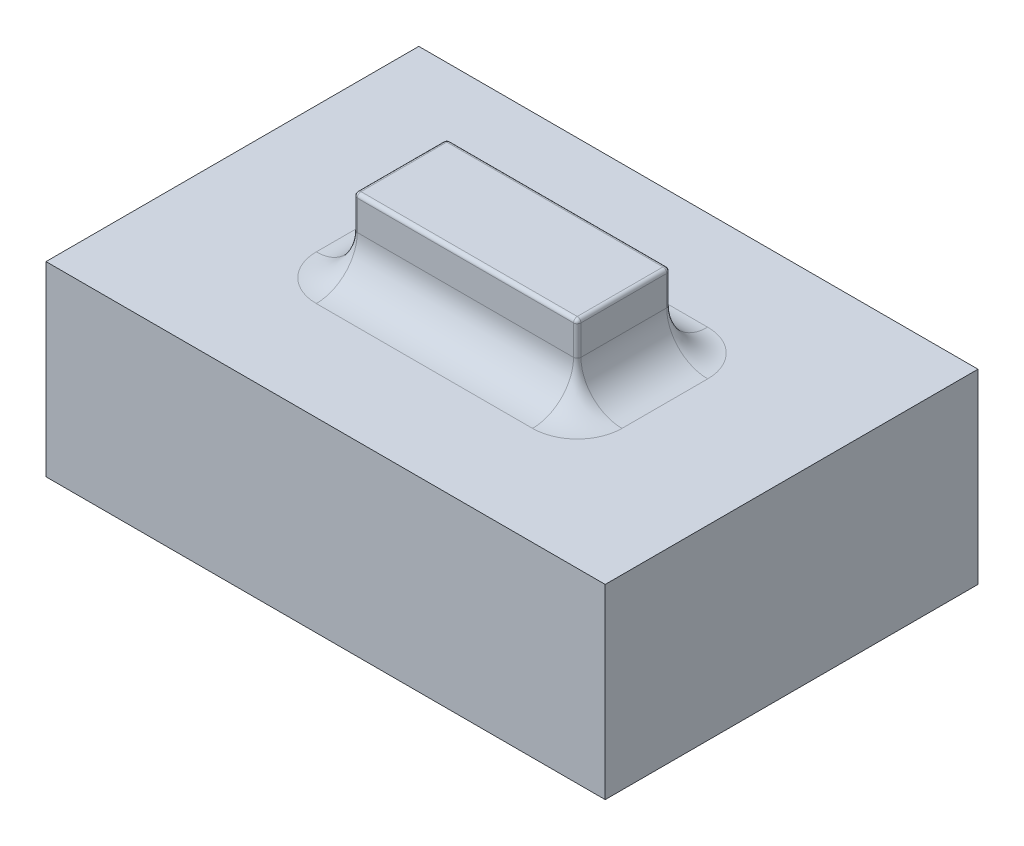
ISO-10303-21;
HEADER;
FILE_DESCRIPTION(('STEP AP214'),'2;1');
FILE_NAME('part.step','',(''),(''),'','','');
FILE_SCHEMA(('AUTOMOTIVE_DESIGN { 1 0 10303 214 1 1 1 1 }'));
ENDSEC;
DATA;
#1=APPLICATION_CONTEXT('core data for automotive mechanical design processes');
#2=APPLICATION_PROTOCOL_DEFINITION('international standard','automotive_design',2000,#1);
#3=PRODUCT_CONTEXT('',#1,'mechanical');
#4=PRODUCT('Part','Part','',(#3));
#5=PRODUCT_RELATED_PRODUCT_CATEGORY('part','',(#4));
#6=PRODUCT_DEFINITION_FORMATION('','',#4);
#7=PRODUCT_DEFINITION_CONTEXT('part definition',#1,'design');
#8=PRODUCT_DEFINITION('design','',#6,#7);
#9=PRODUCT_DEFINITION_SHAPE('','',#8);
#10=(LENGTH_UNIT() NAMED_UNIT(*) SI_UNIT(.MILLI.,.METRE.));
#11=(NAMED_UNIT(*) PLANE_ANGLE_UNIT() SI_UNIT($,.RADIAN.));
#12=(NAMED_UNIT(*) SI_UNIT($,.STERADIAN.) SOLID_ANGLE_UNIT());
#13=UNCERTAINTY_MEASURE_WITH_UNIT(LENGTH_MEASURE(1.E-05),#10,'distance_accuracy_value','');
#14=(GEOMETRIC_REPRESENTATION_CONTEXT(3) GLOBAL_UNCERTAINTY_ASSIGNED_CONTEXT((#13)) GLOBAL_UNIT_ASSIGNED_CONTEXT((#10,
#11,#12)) REPRESENTATION_CONTEXT('',''));
#15=CARTESIAN_POINT('',(0.,0.,0.));
#16=DIRECTION('',(0.,0.,1.));
#17=DIRECTION('',(1.,0.,0.));
#18=AXIS2_PLACEMENT_3D('',#15,#16,#17);
#19=CARTESIAN_POINT('',(0.,5.,0.));
#20=DIRECTION('',(0.,-1.,0.));
#21=DIRECTION('',(0.,0.,-1.));
#22=AXIS2_PLACEMENT_3D('',#19,#20,#21);
#23=PLANE('',#22);
#24=DIRECTION('',(1.,0.,0.));
#25=VECTOR('',#24,1.);
#26=CARTESIAN_POINT('',(-2.9,5.,2.35));
#27=LINE('',#26,#25);
#28=CARTESIAN_POINT('',(2.9,5.,2.35));
#29=VERTEX_POINT('',#28);
#30=CARTESIAN_POINT('',(-2.9,5.,2.35));
#31=VERTEX_POINT('',#30);
#32=EDGE_CURVE('E214',#29,#31,#27,.F.);
#33=ORIENTED_EDGE('',*,*,#32,.T.);
#34=CARTESIAN_POINT('',(-2.9,5.,1.15));
#35=DIRECTION('',(0.,-1.,0.));
#36=DIRECTION('',(0.,0.,-1.));
#37=AXIS2_PLACEMENT_3D('',#34,#35,#36);
#38=CIRCLE('',#37,1.2);
#39=CARTESIAN_POINT('',(-4.1,5.,1.15));
#40=VERTEX_POINT('',#39);
#41=EDGE_CURVE('E228',#31,#40,#38,.T.);
#42=ORIENTED_EDGE('',*,*,#41,.T.);
#43=DIRECTION('',(0.,0.,1.));
#44=VECTOR('',#43,1.);
#45=CARTESIAN_POINT('',(-4.1,5.,-1.15));
#46=LINE('',#45,#44);
#47=CARTESIAN_POINT('',(-4.1,5.,-1.15));
#48=VERTEX_POINT('',#47);
#49=EDGE_CURVE('E226',#40,#48,#46,.F.);
#50=ORIENTED_EDGE('',*,*,#49,.T.);
#51=CARTESIAN_POINT('',(-2.9,5.,-1.15));
#52=DIRECTION('',(0.,-1.,0.));
#53=DIRECTION('',(0.,0.,-1.));
#54=AXIS2_PLACEMENT_3D('',#51,#52,#53);
#55=CIRCLE('',#54,1.2);
#56=CARTESIAN_POINT('',(-2.90000000000001,5.,-2.35));
#57=VERTEX_POINT('',#56);
#58=EDGE_CURVE('E224',#48,#57,#55,.T.);
#59=ORIENTED_EDGE('',*,*,#58,.T.);
#60=DIRECTION('',(-1.,0.,0.));
#61=VECTOR('',#60,1.);
#62=CARTESIAN_POINT('',(2.9,5.,-2.35));
#63=LINE('',#62,#61);
#64=CARTESIAN_POINT('',(2.9,5.,-2.35));
#65=VERTEX_POINT('',#64);
#66=EDGE_CURVE('E222',#57,#65,#63,.F.);
#67=ORIENTED_EDGE('',*,*,#66,.T.);
#68=CARTESIAN_POINT('',(2.9,5.,-1.15));
#69=DIRECTION('',(0.,-1.,0.));
#70=DIRECTION('',(0.,0.,-1.));
#71=AXIS2_PLACEMENT_3D('',#68,#69,#70);
#72=CIRCLE('',#71,1.2);
#73=CARTESIAN_POINT('',(4.1,5.,-1.15));
#74=VERTEX_POINT('',#73);
#75=EDGE_CURVE('E220',#65,#74,#72,.T.);
#76=ORIENTED_EDGE('',*,*,#75,.T.);
#77=DIRECTION('',(0.,0.,-1.));
#78=VECTOR('',#77,1.);
#79=CARTESIAN_POINT('',(4.1,5.,1.15));
#80=LINE('',#79,#78);
#81=CARTESIAN_POINT('',(4.1,5.,1.15));
#82=VERTEX_POINT('',#81);
#83=EDGE_CURVE('E218',#74,#82,#80,.F.);
#84=ORIENTED_EDGE('',*,*,#83,.T.);
#85=CARTESIAN_POINT('',(2.9,5.,1.15));
#86=DIRECTION('',(0.,-1.,0.));
#87=DIRECTION('',(0.,0.,-1.));
#88=AXIS2_PLACEMENT_3D('',#85,#86,#87);
#89=CIRCLE('',#88,1.2);
#90=EDGE_CURVE('E216',#82,#29,#89,.T.);
#91=ORIENTED_EDGE('',*,*,#90,.T.);
#92=EDGE_LOOP('',(#33,#42,#50,#59,#67,#76,#84,#91));
#93=FACE_BOUND('',#92,.T.);
#94=DIRECTION('',(0.,0.,1.));
#95=VECTOR('',#94,1.);
#96=CARTESIAN_POINT('',(-7.5,5.,-5.));
#97=LINE('',#96,#95);
#98=CARTESIAN_POINT('',(-7.5,5.,-5.));
#99=VERTEX_POINT('',#98);
#100=CARTESIAN_POINT('',(-7.5,5.,5.));
#101=VERTEX_POINT('',#100);
#102=EDGE_CURVE('E178',#99,#101,#97,.T.);
#103=ORIENTED_EDGE('',*,*,#102,.T.);
#104=DIRECTION('',(1.,0.,0.));
#105=VECTOR('',#104,1.);
#106=CARTESIAN_POINT('',(7.5,5.,5.));
#107=LINE('',#106,#105);
#108=CARTESIAN_POINT('',(7.5,5.,5.));
#109=VERTEX_POINT('',#108);
#110=EDGE_CURVE('E167',#101,#109,#107,.T.);
#111=ORIENTED_EDGE('',*,*,#110,.T.);
#112=DIRECTION('',(0.,0.,-1.));
#113=VECTOR('',#112,1.);
#114=CARTESIAN_POINT('',(7.5,5.,-5.));
#115=LINE('',#114,#113);
#116=CARTESIAN_POINT('',(7.5,5.,-5.));
#117=VERTEX_POINT('',#116);
#118=EDGE_CURVE('E177',#109,#117,#115,.T.);
#119=ORIENTED_EDGE('',*,*,#118,.T.);
#120=DIRECTION('',(-1.,0.,0.));
#121=VECTOR('',#120,1.);
#122=CARTESIAN_POINT('',(7.5,5.,-5.));
#123=LINE('',#122,#121);
#124=EDGE_CURVE('E182',#117,#99,#123,.T.);
#125=ORIENTED_EDGE('',*,*,#124,.T.);
#126=EDGE_LOOP('',(#103,#111,#119,#125));
#127=FACE_BOUND('',#126,.T.);
#128=ADVANCED_FACE('F40',(#93,#127),#23,.F.);
#129=CARTESIAN_POINT('',(-7.5,5.,-5.));
#130=DIRECTION('',(1.,0.,0.));
#131=DIRECTION('',(0.,0.,-1.));
#132=AXIS2_PLACEMENT_3D('',#129,#130,#131);
#133=PLANE('',#132);
#134=DIRECTION('',(0.,0.,1.));
#135=VECTOR('',#134,1.);
#136=CARTESIAN_POINT('',(-7.5,0.,-5.));
#137=LINE('',#136,#135);
#138=CARTESIAN_POINT('',(-7.5,0.,-5.));
#139=VERTEX_POINT('',#138);
#140=CARTESIAN_POINT('',(-7.5,0.,5.));
#141=VERTEX_POINT('',#140);
#142=EDGE_CURVE('E190',#139,#141,#137,.T.);
#143=ORIENTED_EDGE('',*,*,#142,.T.);
#144=DIRECTION('',(0.,-1.,0.));
#145=VECTOR('',#144,1.);
#146=CARTESIAN_POINT('',(-7.5,5.,5.));
#147=LINE('',#146,#145);
#148=EDGE_CURVE('E171',#101,#141,#147,.T.);
#149=ORIENTED_EDGE('',*,*,#148,.F.);
#150=ORIENTED_EDGE('',*,*,#102,.F.);
#151=DIRECTION('',(0.,-1.,0.));
#152=VECTOR('',#151,1.);
#153=CARTESIAN_POINT('',(-7.5,5.,-5.));
#154=LINE('',#153,#152);
#155=EDGE_CURVE('E747',#99,#139,#154,.T.);
#156=ORIENTED_EDGE('',*,*,#155,.T.);
#157=EDGE_LOOP('',(#143,#149,#150,#156));
#158=FACE_BOUND('',#157,.T.);
#159=ADVANCED_FACE('F188',(#158),#133,.F.);
#160=CARTESIAN_POINT('',(7.5,5.,5.));
#161=DIRECTION('',(0.,0.,-1.));
#162=DIRECTION('',(-1.,0.,0.));
#163=AXIS2_PLACEMENT_3D('',#160,#161,#162);
#164=PLANE('',#163);
#165=DIRECTION('',(1.,0.,0.));
#166=VECTOR('',#165,1.);
#167=CARTESIAN_POINT('',(7.5,0.,5.));
#168=LINE('',#167,#166);
#169=CARTESIAN_POINT('',(7.5,0.,5.));
#170=VERTEX_POINT('',#169);
#171=EDGE_CURVE('E745',#141,#170,#168,.T.);
#172=ORIENTED_EDGE('',*,*,#171,.T.);
#173=DIRECTION('',(0.,-1.,0.));
#174=VECTOR('',#173,1.);
#175=CARTESIAN_POINT('',(7.5,5.,5.));
#176=LINE('',#175,#174);
#177=EDGE_CURVE('E174',#109,#170,#176,.T.);
#178=ORIENTED_EDGE('',*,*,#177,.F.);
#179=ORIENTED_EDGE('',*,*,#110,.F.);
#180=ORIENTED_EDGE('',*,*,#148,.T.);
#181=EDGE_LOOP('',(#172,#178,#179,#180));
#182=FACE_BOUND('',#181,.T.);
#183=ADVANCED_FACE('F169',(#182),#164,.F.);
#184=CARTESIAN_POINT('',(7.5,5.,-5.));
#185=DIRECTION('',(-1.,0.,0.));
#186=DIRECTION('',(0.,0.,1.));
#187=AXIS2_PLACEMENT_3D('',#184,#185,#186);
#188=PLANE('',#187);
#189=DIRECTION('',(0.,0.,-1.));
#190=VECTOR('',#189,1.);
#191=CARTESIAN_POINT('',(7.5,0.,-5.));
#192=LINE('',#191,#190);
#193=CARTESIAN_POINT('',(7.5,0.,-5.));
#194=VERTEX_POINT('',#193);
#195=EDGE_CURVE('E742',#170,#194,#192,.T.);
#196=ORIENTED_EDGE('',*,*,#195,.T.);
#197=DIRECTION('',(0.,-1.,0.));
#198=VECTOR('',#197,1.);
#199=CARTESIAN_POINT('',(7.5,5.,-5.));
#200=LINE('',#199,#198);
#201=EDGE_CURVE('E196',#117,#194,#200,.T.);
#202=ORIENTED_EDGE('',*,*,#201,.F.);
#203=ORIENTED_EDGE('',*,*,#118,.F.);
#204=ORIENTED_EDGE('',*,*,#177,.T.);
#205=EDGE_LOOP('',(#196,#202,#203,#204));
#206=FACE_BOUND('',#205,.T.);
#207=ADVANCED_FACE('F417',(#206),#188,.F.);
#208=CARTESIAN_POINT('',(7.5,5.,-5.));
#209=DIRECTION('',(0.,0.,1.));
#210=DIRECTION('',(1.,0.,0.));
#211=AXIS2_PLACEMENT_3D('',#208,#209,#210);
#212=PLANE('',#211);
#213=DIRECTION('',(-1.,0.,0.));
#214=VECTOR('',#213,1.);
#215=CARTESIAN_POINT('',(7.5,0.,-5.));
#216=LINE('',#215,#214);
#217=EDGE_CURVE('E186',#194,#139,#216,.T.);
#218=ORIENTED_EDGE('',*,*,#217,.T.);
#219=ORIENTED_EDGE('',*,*,#155,.F.);
#220=ORIENTED_EDGE('',*,*,#124,.F.);
#221=ORIENTED_EDGE('',*,*,#201,.T.);
#222=EDGE_LOOP('',(#218,#219,#220,#221));
#223=FACE_BOUND('',#222,.T.);
#224=ADVANCED_FACE('F413',(#223),#212,.F.);
#225=CARTESIAN_POINT('',(0.,0.,0.));
#226=DIRECTION('',(0.,-1.,0.));
#227=DIRECTION('',(0.,0.,-1.));
#228=AXIS2_PLACEMENT_3D('',#225,#226,#227);
#229=PLANE('',#228);
#230=ORIENTED_EDGE('',*,*,#142,.F.);
#231=ORIENTED_EDGE('',*,*,#217,.F.);
#232=ORIENTED_EDGE('',*,*,#195,.F.);
#233=ORIENTED_EDGE('',*,*,#171,.F.);
#234=EDGE_LOOP('',(#230,#231,#232,#233));
#235=FACE_BOUND('',#234,.T.);
#236=ADVANCED_FACE('F410',(#235),#229,.T.);
#237=CARTESIAN_POINT('',(-3.,7.,-1.25));
#238=DIRECTION('',(1.,0.,0.));
#239=DIRECTION('',(0.,0.,-1.));
#240=AXIS2_PLACEMENT_3D('',#237,#238,#239);
#241=PLANE('',#240);
#242=DIRECTION('',(0.,-1.,0.));
#243=VECTOR('',#242,1.);
#244=CARTESIAN_POINT('',(-3.,7.,1.15));
#245=LINE('',#244,#243);
#246=CARTESIAN_POINT('',(-3.,6.1,1.15));
#247=VERTEX_POINT('',#246);
#248=CARTESIAN_POINT('',(-3.,6.9,1.15));
#249=VERTEX_POINT('',#248);
#250=EDGE_CURVE('E191',#247,#249,#245,.F.);
#251=ORIENTED_EDGE('',*,*,#250,.T.);
#252=DIRECTION('',(0.,0.,1.));
#253=VECTOR('',#252,1.);
#254=CARTESIAN_POINT('',(-3.,6.9,-1.25));
#255=LINE('',#254,#253);
#256=CARTESIAN_POINT('',(-3.,6.9,-1.15));
#257=VERTEX_POINT('',#256);
#258=EDGE_CURVE('E286',#249,#257,#255,.F.);
#259=ORIENTED_EDGE('',*,*,#258,.T.);
#260=DIRECTION('',(0.,-1.,0.));
#261=VECTOR('',#260,1.);
#262=CARTESIAN_POINT('',(-3.,7.,-1.15));
#263=LINE('',#262,#261);
#264=CARTESIAN_POINT('',(-3.,6.1,-1.15));
#265=VERTEX_POINT('',#264);
#266=EDGE_CURVE('E194',#257,#265,#263,.T.);
#267=ORIENTED_EDGE('',*,*,#266,.T.);
#268=DIRECTION('',(0.,0.,1.));
#269=VECTOR('',#268,1.);
#270=CARTESIAN_POINT('',(-3.,6.1,1.15));
#271=LINE('',#270,#269);
#272=EDGE_CURVE('E234',#265,#247,#271,.T.);
#273=ORIENTED_EDGE('',*,*,#272,.T.);
#274=EDGE_LOOP('',(#251,#259,#267,#273));
#275=FACE_BOUND('',#274,.T.);
#276=ADVANCED_FACE('F408',(#275),#241,.F.);
#277=CARTESIAN_POINT('',(3.,7.,1.25));
#278=DIRECTION('',(0.,0.,-1.));
#279=DIRECTION('',(-1.,0.,0.));
#280=AXIS2_PLACEMENT_3D('',#277,#278,#279);
#281=PLANE('',#280);
#282=DIRECTION('',(0.,-1.,0.));
#283=VECTOR('',#282,1.);
#284=CARTESIAN_POINT('',(2.9,7.,1.25));
#285=LINE('',#284,#283);
#286=CARTESIAN_POINT('',(2.9,6.1,1.25));
#287=VERTEX_POINT('',#286);
#288=CARTESIAN_POINT('',(2.9,6.9,1.25));
#289=VERTEX_POINT('',#288);
#290=EDGE_CURVE('E212',#287,#289,#285,.F.);
#291=ORIENTED_EDGE('',*,*,#290,.T.);
#292=DIRECTION('',(1.,0.,0.));
#293=VECTOR('',#292,1.);
#294=CARTESIAN_POINT('',(3.,6.9,1.25));
#295=LINE('',#294,#293);
#296=CARTESIAN_POINT('',(-2.9,6.9,1.25));
#297=VERTEX_POINT('',#296);
#298=EDGE_CURVE('E12',#289,#297,#295,.F.);
#299=ORIENTED_EDGE('',*,*,#298,.T.);
#300=DIRECTION('',(0.,-1.,0.));
#301=VECTOR('',#300,1.);
#302=CARTESIAN_POINT('',(-2.9,7.,1.25));
#303=LINE('',#302,#301);
#304=CARTESIAN_POINT('',(-2.9,6.1,1.25));
#305=VERTEX_POINT('',#304);
#306=EDGE_CURVE('E210',#297,#305,#303,.T.);
#307=ORIENTED_EDGE('',*,*,#306,.T.);
#308=DIRECTION('',(1.,0.,0.));
#309=VECTOR('',#308,1.);
#310=CARTESIAN_POINT('',(2.9,6.1,1.25));
#311=LINE('',#310,#309);
#312=EDGE_CURVE('E249',#305,#287,#311,.T.);
#313=ORIENTED_EDGE('',*,*,#312,.T.);
#314=EDGE_LOOP('',(#291,#299,#307,#313));
#315=FACE_BOUND('',#314,.T.);
#316=ADVANCED_FACE('F385',(#315),#281,.F.);
#317=CARTESIAN_POINT('',(3.,7.,-1.25));
#318=DIRECTION('',(-1.,0.,0.));
#319=DIRECTION('',(0.,0.,1.));
#320=AXIS2_PLACEMENT_3D('',#317,#318,#319);
#321=PLANE('',#320);
#322=DIRECTION('',(0.,-1.,0.));
#323=VECTOR('',#322,1.);
#324=CARTESIAN_POINT('',(3.,7.,-1.15));
#325=LINE('',#324,#323);
#326=CARTESIAN_POINT('',(3.,6.1,-1.15));
#327=VERTEX_POINT('',#326);
#328=CARTESIAN_POINT('',(3.,6.9,-1.15));
#329=VERTEX_POINT('',#328);
#330=EDGE_CURVE('E208',#327,#329,#325,.F.);
#331=ORIENTED_EDGE('',*,*,#330,.T.);
#332=DIRECTION('',(0.,0.,-1.));
#333=VECTOR('',#332,1.);
#334=CARTESIAN_POINT('',(3.,6.9,-1.25));
#335=LINE('',#334,#333);
#336=CARTESIAN_POINT('',(3.,6.9,1.15));
#337=VERTEX_POINT('',#336);
#338=EDGE_CURVE('E64',#329,#337,#335,.F.);
#339=ORIENTED_EDGE('',*,*,#338,.T.);
#340=DIRECTION('',(0.,-1.,0.));
#341=VECTOR('',#340,1.);
#342=CARTESIAN_POINT('',(3.,7.,1.15));
#343=LINE('',#342,#341);
#344=CARTESIAN_POINT('',(3.,6.1,1.15));
#345=VERTEX_POINT('',#344);
#346=EDGE_CURVE('E206',#337,#345,#343,.T.);
#347=ORIENTED_EDGE('',*,*,#346,.T.);
#348=DIRECTION('',(0.,0.,-1.));
#349=VECTOR('',#348,1.);
#350=CARTESIAN_POINT('',(3.,6.1,-1.15));
#351=LINE('',#350,#349);
#352=EDGE_CURVE('E244',#345,#327,#351,.T.);
#353=ORIENTED_EDGE('',*,*,#352,.T.);
#354=EDGE_LOOP('',(#331,#339,#347,#353));
#355=FACE_BOUND('',#354,.T.);
#356=ADVANCED_FACE('F330',(#355),#321,.F.);
#357=CARTESIAN_POINT('',(3.,7.,-1.25));
#358=DIRECTION('',(0.,0.,1.));
#359=DIRECTION('',(1.,0.,0.));
#360=AXIS2_PLACEMENT_3D('',#357,#358,#359);
#361=PLANE('',#360);
#362=DIRECTION('',(0.,-1.,0.));
#363=VECTOR('',#362,1.);
#364=CARTESIAN_POINT('',(-2.9,7.,-1.25));
#365=LINE('',#364,#363);
#366=CARTESIAN_POINT('',(-2.9,6.1,-1.25));
#367=VERTEX_POINT('',#366);
#368=CARTESIAN_POINT('',(-2.9,6.9,-1.25));
#369=VERTEX_POINT('',#368);
#370=EDGE_CURVE('E203',#367,#369,#365,.F.);
#371=ORIENTED_EDGE('',*,*,#370,.T.);
#372=DIRECTION('',(-1.,0.,0.));
#373=VECTOR('',#372,1.);
#374=CARTESIAN_POINT('',(3.,6.9,-1.25));
#375=LINE('',#374,#373);
#376=CARTESIAN_POINT('',(2.9,6.9,-1.25));
#377=VERTEX_POINT('',#376);
#378=EDGE_CURVE('E290',#369,#377,#375,.F.);
#379=ORIENTED_EDGE('',*,*,#378,.T.);
#380=DIRECTION('',(0.,-1.,0.));
#381=VECTOR('',#380,1.);
#382=CARTESIAN_POINT('',(2.9,7.,-1.25));
#383=LINE('',#382,#381);
#384=CARTESIAN_POINT('',(2.9,6.1,-1.25));
#385=VERTEX_POINT('',#384);
#386=EDGE_CURVE('E201',#377,#385,#383,.T.);
#387=ORIENTED_EDGE('',*,*,#386,.T.);
#388=DIRECTION('',(-1.,0.,0.));
#389=VECTOR('',#388,1.);
#390=CARTESIAN_POINT('',(-2.9,6.1,-1.25));
#391=LINE('',#390,#389);
#392=EDGE_CURVE('E239',#385,#367,#391,.T.);
#393=ORIENTED_EDGE('',*,*,#392,.T.);
#394=EDGE_LOOP('',(#371,#379,#387,#393));
#395=FACE_BOUND('',#394,.T.);
#396=ADVANCED_FACE('F357',(#395),#361,.F.);
#397=CARTESIAN_POINT('',(0.,7.,0.));
#398=DIRECTION('',(0.,-1.,0.));
#399=DIRECTION('',(0.,0.,-1.));
#400=AXIS2_PLACEMENT_3D('',#397,#398,#399);
#401=PLANE('',#400);
#402=DIRECTION('',(-1.,0.,0.));
#403=VECTOR('',#402,1.);
#404=CARTESIAN_POINT('',(0.,7.,-1.15));
#405=LINE('',#404,#403);
#406=CARTESIAN_POINT('',(2.9,7.,-1.15));
#407=VERTEX_POINT('',#406);
#408=CARTESIAN_POINT('',(-2.9,7.,-1.15));
#409=VERTEX_POINT('',#408);
#410=EDGE_CURVE('E281',#407,#409,#405,.T.);
#411=ORIENTED_EDGE('',*,*,#410,.T.);
#412=DIRECTION('',(0.,0.,1.));
#413=VECTOR('',#412,1.);
#414=CARTESIAN_POINT('',(-2.9,7.,0.));
#415=LINE('',#414,#413);
#416=CARTESIAN_POINT('',(-2.9,7.,1.15));
#417=VERTEX_POINT('',#416);
#418=EDGE_CURVE('E283',#409,#417,#415,.T.);
#419=ORIENTED_EDGE('',*,*,#418,.T.);
#420=DIRECTION('',(1.,0.,0.));
#421=VECTOR('',#420,1.);
#422=CARTESIAN_POINT('',(0.,7.,1.15));
#423=LINE('',#422,#421);
#424=CARTESIAN_POINT('',(2.9,7.,1.15));
#425=VERTEX_POINT('',#424);
#426=EDGE_CURVE('E277',#417,#425,#423,.T.);
#427=ORIENTED_EDGE('',*,*,#426,.T.);
#428=DIRECTION('',(0.,0.,-1.));
#429=VECTOR('',#428,1.);
#430=CARTESIAN_POINT('',(2.9,7.,0.));
#431=LINE('',#430,#429);
#432=EDGE_CURVE('E279',#425,#407,#431,.T.);
#433=ORIENTED_EDGE('',*,*,#432,.T.);
#434=EDGE_LOOP('',(#411,#419,#427,#433));
#435=FACE_BOUND('',#434,.T.);
#436=ADVANCED_FACE('F373',(#435),#401,.F.);
#437=CARTESIAN_POINT('',(-2.9,7.,-1.15));
#438=DIRECTION('',(0.,-1.,0.));
#439=DIRECTION('',(0.,0.,-1.));
#440=AXIS2_PLACEMENT_3D('',#437,#438,#439);
#441=CYLINDRICAL_SURFACE('',#440,0.1);
#442=ORIENTED_EDGE('',*,*,#266,.F.);
#443=CARTESIAN_POINT('',(-2.9,6.9,-1.15));
#444=DIRECTION('',(0.,-1.,0.));
#445=DIRECTION('',(0.,0.,-1.));
#446=AXIS2_PLACEMENT_3D('',#443,#444,#445);
#447=CIRCLE('',#446,0.1);
#448=EDGE_CURVE('E288',#257,#369,#447,.T.);
#449=ORIENTED_EDGE('',*,*,#448,.T.);
#450=ORIENTED_EDGE('',*,*,#370,.F.);
#451=CARTESIAN_POINT('',(-2.9,6.1,-1.15));
#452=DIRECTION('',(0.,-1.,0.));
#453=DIRECTION('',(0.,0.,-1.));
#454=AXIS2_PLACEMENT_3D('',#451,#452,#453);
#455=CIRCLE('',#454,0.1);
#456=EDGE_CURVE('E236',#367,#265,#455,.F.);
#457=ORIENTED_EDGE('',*,*,#456,.T.);
#458=EDGE_LOOP('',(#442,#449,#450,#457));
#459=FACE_BOUND('',#458,.T.);
#460=ADVANCED_FACE('F360',(#459),#441,.T.);
#461=CARTESIAN_POINT('',(2.9,7.,-1.15));
#462=DIRECTION('',(0.,-1.,0.));
#463=DIRECTION('',(0.,0.,-1.));
#464=AXIS2_PLACEMENT_3D('',#461,#462,#463);
#465=CYLINDRICAL_SURFACE('',#464,0.1);
#466=ORIENTED_EDGE('',*,*,#386,.F.);
#467=CARTESIAN_POINT('',(2.9,6.9,-1.15));
#468=DIRECTION('',(0.,-1.,0.));
#469=DIRECTION('',(0.,0.,-1.));
#470=AXIS2_PLACEMENT_3D('',#467,#468,#469);
#471=CIRCLE('',#470,0.1);
#472=EDGE_CURVE('E292',#377,#329,#471,.T.);
#473=ORIENTED_EDGE('',*,*,#472,.T.);
#474=ORIENTED_EDGE('',*,*,#330,.F.);
#475=CARTESIAN_POINT('',(2.9,6.1,-1.15));
#476=DIRECTION('',(0.,-1.,0.));
#477=DIRECTION('',(0.,0.,-1.));
#478=AXIS2_PLACEMENT_3D('',#475,#476,#477);
#479=CIRCLE('',#478,0.1);
#480=EDGE_CURVE('E241',#327,#385,#479,.F.);
#481=ORIENTED_EDGE('',*,*,#480,.T.);
#482=EDGE_LOOP('',(#466,#473,#474,#481));
#483=FACE_BOUND('',#482,.T.);
#484=ADVANCED_FACE('F328',(#483),#465,.T.);
#485=CARTESIAN_POINT('',(2.9,7.,1.15));
#486=DIRECTION('',(0.,-1.,0.));
#487=DIRECTION('',(0.,0.,-1.));
#488=AXIS2_PLACEMENT_3D('',#485,#486,#487);
#489=CYLINDRICAL_SURFACE('',#488,0.1);
#490=ORIENTED_EDGE('',*,*,#346,.F.);
#491=CARTESIAN_POINT('',(2.9,6.9,1.15));
#492=DIRECTION('',(0.,-1.,0.));
#493=DIRECTION('',(0.,0.,-1.));
#494=AXIS2_PLACEMENT_3D('',#491,#492,#493);
#495=CIRCLE('',#494,0.1);
#496=EDGE_CURVE('E49',#337,#289,#495,.T.);
#497=ORIENTED_EDGE('',*,*,#496,.T.);
#498=ORIENTED_EDGE('',*,*,#290,.F.);
#499=CARTESIAN_POINT('',(2.9,6.1,1.15));
#500=DIRECTION('',(0.,-1.,0.));
#501=DIRECTION('',(0.,0.,-1.));
#502=AXIS2_PLACEMENT_3D('',#499,#500,#501);
#503=CIRCLE('',#502,0.1);
#504=EDGE_CURVE('E246',#287,#345,#503,.F.);
#505=ORIENTED_EDGE('',*,*,#504,.T.);
#506=EDGE_LOOP('',(#490,#497,#498,#505));
#507=FACE_BOUND('',#506,.T.);
#508=ADVANCED_FACE('F428',(#507),#489,.T.);
#509=CARTESIAN_POINT('',(-2.9,7.,1.15));
#510=DIRECTION('',(0.,-1.,0.));
#511=DIRECTION('',(0.,0.,-1.));
#512=AXIS2_PLACEMENT_3D('',#509,#510,#511);
#513=CYLINDRICAL_SURFACE('',#512,0.1);
#514=ORIENTED_EDGE('',*,*,#306,.F.);
#515=CARTESIAN_POINT('',(-2.9,6.9,1.15));
#516=DIRECTION('',(0.,-1.,0.));
#517=DIRECTION('',(0.,0.,-1.));
#518=AXIS2_PLACEMENT_3D('',#515,#516,#517);
#519=CIRCLE('',#518,0.1);
#520=EDGE_CURVE('E251',#297,#249,#519,.T.);
#521=ORIENTED_EDGE('',*,*,#520,.T.);
#522=ORIENTED_EDGE('',*,*,#250,.F.);
#523=CARTESIAN_POINT('',(-2.9,6.1,1.15));
#524=DIRECTION('',(0.,-1.,0.));
#525=DIRECTION('',(0.,0.,-1.));
#526=AXIS2_PLACEMENT_3D('',#523,#524,#525);
#527=CIRCLE('',#526,0.1);
#528=EDGE_CURVE('E231',#247,#305,#527,.F.);
#529=ORIENTED_EDGE('',*,*,#528,.T.);
#530=EDGE_LOOP('',(#514,#521,#522,#529));
#531=FACE_BOUND('',#530,.T.);
#532=ADVANCED_FACE('F388',(#531),#513,.T.);
#533=CARTESIAN_POINT('',(2.9,6.1,-1.15));
#534=DIRECTION('',(0.,-1.,0.));
#535=DIRECTION('',(0.,0.,-1.));
#536=AXIS2_PLACEMENT_3D('',#533,#534,#535);
#537=TOROIDAL_SURFACE('',#536,1.2,1.1);
#538=CARTESIAN_POINT('',(2.9,6.1,-2.35));
#539=DIRECTION('',(1.,0.,0.));
#540=DIRECTION('',(0.,1.,0.));
#541=AXIS2_PLACEMENT_3D('',#538,#539,#540);
#542=CIRCLE('',#541,1.1);
#543=EDGE_CURVE('E269',#385,#65,#542,.T.);
#544=ORIENTED_EDGE('',*,*,#543,.F.);
#545=ORIENTED_EDGE('',*,*,#480,.F.);
#546=CARTESIAN_POINT('',(4.1,6.1,-1.15));
#547=DIRECTION('',(0.,0.,-1.));
#548=DIRECTION('',(-1.,0.,0.));
#549=AXIS2_PLACEMENT_3D('',#546,#547,#548);
#550=CIRCLE('',#549,1.1);
#551=EDGE_CURVE('E272',#74,#327,#550,.T.);
#552=ORIENTED_EDGE('',*,*,#551,.F.);
#553=ORIENTED_EDGE('',*,*,#75,.F.);
#554=EDGE_LOOP('',(#544,#545,#552,#553));
#555=FACE_BOUND('',#554,.T.);
#556=ADVANCED_FACE('F349',(#555),#537,.F.);
#557=CARTESIAN_POINT('',(4.1,6.1,-1.25));
#558=DIRECTION('',(0.,0.,1.));
#559=DIRECTION('',(1.,0.,0.));
#560=AXIS2_PLACEMENT_3D('',#557,#558,#559);
#561=CYLINDRICAL_SURFACE('',#560,1.1);
#562=ORIENTED_EDGE('',*,*,#551,.T.);
#563=ORIENTED_EDGE('',*,*,#352,.F.);
#564=CARTESIAN_POINT('',(4.1,6.1,1.15));
#565=DIRECTION('',(0.,0.,-1.));
#566=DIRECTION('',(-1.,0.,0.));
#567=AXIS2_PLACEMENT_3D('',#564,#565,#566);
#568=CIRCLE('',#567,1.1);
#569=EDGE_CURVE('E266',#82,#345,#568,.T.);
#570=ORIENTED_EDGE('',*,*,#569,.F.);
#571=ORIENTED_EDGE('',*,*,#83,.F.);
#572=EDGE_LOOP('',(#562,#563,#570,#571));
#573=FACE_BOUND('',#572,.T.);
#574=ADVANCED_FACE('F334',(#573),#561,.F.);
#575=CARTESIAN_POINT('',(3.,6.1,-2.35));
#576=DIRECTION('',(1.,0.,0.));
#577=DIRECTION('',(0.,0.,-1.));
#578=AXIS2_PLACEMENT_3D('',#575,#576,#577);
#579=CYLINDRICAL_SURFACE('',#578,1.1);
#580=ORIENTED_EDGE('',*,*,#543,.T.);
#581=ORIENTED_EDGE('',*,*,#66,.F.);
#582=CARTESIAN_POINT('',(-2.9,6.1,-2.35));
#583=DIRECTION('',(1.,0.,0.));
#584=DIRECTION('',(0.,1.,0.));
#585=AXIS2_PLACEMENT_3D('',#582,#583,#584);
#586=CIRCLE('',#585,1.1);
#587=EDGE_CURVE('E263',#367,#57,#586,.T.);
#588=ORIENTED_EDGE('',*,*,#587,.F.);
#589=ORIENTED_EDGE('',*,*,#392,.F.);
#590=EDGE_LOOP('',(#580,#581,#588,#589));
#591=FACE_BOUND('',#590,.T.);
#592=ADVANCED_FACE('F353',(#591),#579,.F.);
#593=CARTESIAN_POINT('',(2.9,6.1,1.15));
#594=DIRECTION('',(0.,-1.,0.));
#595=DIRECTION('',(0.,0.,-1.));
#596=AXIS2_PLACEMENT_3D('',#593,#594,#595);
#597=TOROIDAL_SURFACE('',#596,1.2,1.1);
#598=ORIENTED_EDGE('',*,*,#569,.T.);
#599=ORIENTED_EDGE('',*,*,#504,.F.);
#600=CARTESIAN_POINT('',(2.9,6.1,2.35));
#601=DIRECTION('',(1.,0.,0.));
#602=DIRECTION('',(0.,0.,-1.));
#603=AXIS2_PLACEMENT_3D('',#600,#601,#602);
#604=CIRCLE('',#603,1.1);
#605=EDGE_CURVE('E260',#29,#287,#604,.T.);
#606=ORIENTED_EDGE('',*,*,#605,.F.);
#607=ORIENTED_EDGE('',*,*,#90,.F.);
#608=EDGE_LOOP('',(#598,#599,#606,#607));
#609=FACE_BOUND('',#608,.T.);
#610=ADVANCED_FACE('F340',(#609),#597,.F.);
#611=CARTESIAN_POINT('',(-2.9,6.1,-1.15));
#612=DIRECTION('',(0.,-1.,0.));
#613=DIRECTION('',(0.,0.,-1.));
#614=AXIS2_PLACEMENT_3D('',#611,#612,#613);
#615=TOROIDAL_SURFACE('',#614,1.2,1.1);
#616=ORIENTED_EDGE('',*,*,#587,.T.);
#617=ORIENTED_EDGE('',*,*,#58,.F.);
#618=CARTESIAN_POINT('',(-4.1,6.1,-1.15));
#619=DIRECTION('',(0.,0.,-1.));
#620=DIRECTION('',(0.,1.,0.));
#621=AXIS2_PLACEMENT_3D('',#618,#619,#620);
#622=CIRCLE('',#621,1.1);
#623=EDGE_CURVE('E257',#265,#48,#622,.T.);
#624=ORIENTED_EDGE('',*,*,#623,.F.);
#625=ORIENTED_EDGE('',*,*,#456,.F.);
#626=EDGE_LOOP('',(#616,#617,#624,#625));
#627=FACE_BOUND('',#626,.T.);
#628=ADVANCED_FACE('F444',(#627),#615,.F.);
#629=CARTESIAN_POINT('',(3.,6.1,2.35));
#630=DIRECTION('',(-1.,0.,0.));
#631=DIRECTION('',(0.,0.,1.));
#632=AXIS2_PLACEMENT_3D('',#629,#630,#631);
#633=CYLINDRICAL_SURFACE('',#632,1.1);
#634=ORIENTED_EDGE('',*,*,#605,.T.);
#635=ORIENTED_EDGE('',*,*,#312,.F.);
#636=CARTESIAN_POINT('',(-2.9,6.1,2.35));
#637=DIRECTION('',(1.,0.,0.));
#638=DIRECTION('',(0.,0.,-1.));
#639=AXIS2_PLACEMENT_3D('',#636,#637,#638);
#640=CIRCLE('',#639,1.1);
#641=EDGE_CURVE('E254',#31,#305,#640,.T.);
#642=ORIENTED_EDGE('',*,*,#641,.F.);
#643=ORIENTED_EDGE('',*,*,#32,.F.);
#644=EDGE_LOOP('',(#634,#635,#642,#643));
#645=FACE_BOUND('',#644,.T.);
#646=ADVANCED_FACE('F440',(#645),#633,.F.);
#647=CARTESIAN_POINT('',(-4.1,6.1,-1.25));
#648=DIRECTION('',(0.,0.,-1.));
#649=DIRECTION('',(-1.,0.,0.));
#650=AXIS2_PLACEMENT_3D('',#647,#648,#649);
#651=CYLINDRICAL_SURFACE('',#650,1.1);
#652=ORIENTED_EDGE('',*,*,#623,.T.);
#653=ORIENTED_EDGE('',*,*,#49,.F.);
#654=CARTESIAN_POINT('',(-4.1,6.1,1.15));
#655=DIRECTION('',(0.,0.,-1.));
#656=DIRECTION('',(0.,1.,0.));
#657=AXIS2_PLACEMENT_3D('',#654,#655,#656);
#658=CIRCLE('',#657,1.1);
#659=EDGE_CURVE('E252',#247,#40,#658,.T.);
#660=ORIENTED_EDGE('',*,*,#659,.F.);
#661=ORIENTED_EDGE('',*,*,#272,.F.);
#662=EDGE_LOOP('',(#652,#653,#660,#661));
#663=FACE_BOUND('',#662,.T.);
#664=ADVANCED_FACE('F436',(#663),#651,.F.);
#665=CARTESIAN_POINT('',(-2.9,6.1,1.15));
#666=DIRECTION('',(0.,-1.,0.));
#667=DIRECTION('',(0.,0.,-1.));
#668=AXIS2_PLACEMENT_3D('',#665,#666,#667);
#669=TOROIDAL_SURFACE('',#668,1.2,1.1);
#670=ORIENTED_EDGE('',*,*,#641,.T.);
#671=ORIENTED_EDGE('',*,*,#528,.F.);
#672=ORIENTED_EDGE('',*,*,#659,.T.);
#673=ORIENTED_EDGE('',*,*,#41,.F.);
#674=EDGE_LOOP('',(#670,#671,#672,#673));
#675=FACE_BOUND('',#674,.T.);
#676=ADVANCED_FACE('F433',(#675),#669,.F.);
#677=CARTESIAN_POINT('',(2.9,6.9,-1.15));
#678=DIRECTION('',(0.,-1.,0.));
#679=DIRECTION('',(0.,0.,-1.));
#680=AXIS2_PLACEMENT_3D('',#677,#678,#679);
#681=SPHERICAL_SURFACE('',#680,0.1);
#682=CARTESIAN_POINT('',(2.9,6.9,-1.15));
#683=DIRECTION('',(0.,0.,1.));
#684=DIRECTION('',(1.,0.,0.));
#685=AXIS2_PLACEMENT_3D('',#682,#683,#684);
#686=CIRCLE('',#685,0.1);
#687=EDGE_CURVE('E311',#329,#407,#686,.T.);
#688=ORIENTED_EDGE('',*,*,#687,.F.);
#689=ORIENTED_EDGE('',*,*,#472,.F.);
#690=CARTESIAN_POINT('',(2.9,6.9,-1.15));
#691=DIRECTION('',(-1.,0.,0.));
#692=DIRECTION('',(0.,0.,1.));
#693=AXIS2_PLACEMENT_3D('',#690,#691,#692);
#694=CIRCLE('',#693,0.1);
#695=EDGE_CURVE('E44',#407,#377,#694,.T.);
#696=ORIENTED_EDGE('',*,*,#695,.F.);
#697=EDGE_LOOP('',(#688,#689,#696));
#698=FACE_BOUND('',#697,.T.);
#699=ADVANCED_FACE('F42',(#698),#681,.T.);
#700=CARTESIAN_POINT('',(0.,6.9,-1.15));
#701=DIRECTION('',(-1.,0.,0.));
#702=DIRECTION('',(0.,0.,1.));
#703=AXIS2_PLACEMENT_3D('',#700,#701,#702);
#704=CYLINDRICAL_SURFACE('',#703,0.1);
#705=ORIENTED_EDGE('',*,*,#695,.T.);
#706=ORIENTED_EDGE('',*,*,#378,.F.);
#707=CARTESIAN_POINT('',(-2.9,6.9,-1.15));
#708=DIRECTION('',(-1.,0.,0.));
#709=DIRECTION('',(0.,0.,1.));
#710=AXIS2_PLACEMENT_3D('',#707,#708,#709);
#711=CIRCLE('',#710,0.1);
#712=EDGE_CURVE('E309',#409,#369,#711,.T.);
#713=ORIENTED_EDGE('',*,*,#712,.F.);
#714=ORIENTED_EDGE('',*,*,#410,.F.);
#715=EDGE_LOOP('',(#705,#706,#713,#714));
#716=FACE_BOUND('',#715,.T.);
#717=ADVANCED_FACE('F321',(#716),#704,.T.);
#718=CARTESIAN_POINT('',(2.9,6.9,0.));
#719=DIRECTION('',(0.,0.,-1.));
#720=DIRECTION('',(-1.,0.,0.));
#721=AXIS2_PLACEMENT_3D('',#718,#719,#720);
#722=CYLINDRICAL_SURFACE('',#721,0.1);
#723=ORIENTED_EDGE('',*,*,#687,.T.);
#724=ORIENTED_EDGE('',*,*,#432,.F.);
#725=CARTESIAN_POINT('',(2.9,6.9,1.15));
#726=DIRECTION('',(0.,0.,1.));
#727=DIRECTION('',(1.,0.,0.));
#728=AXIS2_PLACEMENT_3D('',#725,#726,#727);
#729=CIRCLE('',#728,0.1);
#730=EDGE_CURVE('E306',#337,#425,#729,.T.);
#731=ORIENTED_EDGE('',*,*,#730,.F.);
#732=ORIENTED_EDGE('',*,*,#338,.F.);
#733=EDGE_LOOP('',(#723,#724,#731,#732));
#734=FACE_BOUND('',#733,.T.);
#735=ADVANCED_FACE('F375',(#734),#722,.T.);
#736=CARTESIAN_POINT('',(-2.9,6.9,-1.15));
#737=DIRECTION('',(0.,-1.,0.));
#738=DIRECTION('',(0.,0.,-1.));
#739=AXIS2_PLACEMENT_3D('',#736,#737,#738);
#740=SPHERICAL_SURFACE('',#739,0.1);
#741=ORIENTED_EDGE('',*,*,#712,.T.);
#742=ORIENTED_EDGE('',*,*,#448,.F.);
#743=CARTESIAN_POINT('',(-2.9,6.9,-1.15));
#744=DIRECTION('',(0.,0.,1.));
#745=DIRECTION('',(1.,0.,0.));
#746=AXIS2_PLACEMENT_3D('',#743,#744,#745);
#747=CIRCLE('',#746,0.1);
#748=EDGE_CURVE('E303',#409,#257,#747,.T.);
#749=ORIENTED_EDGE('',*,*,#748,.F.);
#750=EDGE_LOOP('',(#741,#742,#749));
#751=FACE_BOUND('',#750,.T.);
#752=ADVANCED_FACE('F365',(#751),#740,.T.);
#753=CARTESIAN_POINT('',(2.9,6.9,1.15));
#754=DIRECTION('',(0.,-1.,0.));
#755=DIRECTION('',(0.,0.,-1.));
#756=AXIS2_PLACEMENT_3D('',#753,#754,#755);
#757=SPHERICAL_SURFACE('',#756,0.1);
#758=ORIENTED_EDGE('',*,*,#496,.F.);
#759=ORIENTED_EDGE('',*,*,#730,.T.);
#760=CARTESIAN_POINT('',(2.9,6.9,1.15));
#761=DIRECTION('',(-1.,0.,0.));
#762=DIRECTION('',(0.,0.,1.));
#763=AXIS2_PLACEMENT_3D('',#760,#761,#762);
#764=CIRCLE('',#763,0.1);
#765=EDGE_CURVE('E300',#289,#425,#764,.T.);
#766=ORIENTED_EDGE('',*,*,#765,.F.);
#767=EDGE_LOOP('',(#758,#759,#766));
#768=FACE_BOUND('',#767,.T.);
#769=ADVANCED_FACE('F378',(#768),#757,.T.);
#770=CARTESIAN_POINT('',(-2.9,6.9,0.));
#771=DIRECTION('',(0.,0.,1.));
#772=DIRECTION('',(1.,0.,0.));
#773=AXIS2_PLACEMENT_3D('',#770,#771,#772);
#774=CYLINDRICAL_SURFACE('',#773,0.1);
#775=ORIENTED_EDGE('',*,*,#748,.T.);
#776=ORIENTED_EDGE('',*,*,#258,.F.);
#777=CARTESIAN_POINT('',(-2.9,6.9,1.15));
#778=DIRECTION('',(0.,0.,1.));
#779=DIRECTION('',(1.,0.,0.));
#780=AXIS2_PLACEMENT_3D('',#777,#778,#779);
#781=CIRCLE('',#780,0.1);
#782=EDGE_CURVE('E298',#417,#249,#781,.T.);
#783=ORIENTED_EDGE('',*,*,#782,.F.);
#784=ORIENTED_EDGE('',*,*,#418,.F.);
#785=EDGE_LOOP('',(#775,#776,#783,#784));
#786=FACE_BOUND('',#785,.T.);
#787=ADVANCED_FACE('F369',(#786),#774,.T.);
#788=CARTESIAN_POINT('',(0.,6.9,1.15));
#789=DIRECTION('',(1.,0.,0.));
#790=DIRECTION('',(0.,0.,-1.));
#791=AXIS2_PLACEMENT_3D('',#788,#789,#790);
#792=CYLINDRICAL_SURFACE('',#791,0.1);
#793=ORIENTED_EDGE('',*,*,#765,.T.);
#794=ORIENTED_EDGE('',*,*,#426,.F.);
#795=CARTESIAN_POINT('',(-2.9,6.9,1.15));
#796=DIRECTION('',(-1.,0.,0.));
#797=DIRECTION('',(0.,0.,1.));
#798=AXIS2_PLACEMENT_3D('',#795,#796,#797);
#799=CIRCLE('',#798,0.1);
#800=EDGE_CURVE('E296',#297,#417,#799,.T.);
#801=ORIENTED_EDGE('',*,*,#800,.F.);
#802=ORIENTED_EDGE('',*,*,#298,.F.);
#803=EDGE_LOOP('',(#793,#794,#801,#802));
#804=FACE_BOUND('',#803,.T.);
#805=ADVANCED_FACE('F381',(#804),#792,.T.);
#806=CARTESIAN_POINT('',(-2.9,6.9,1.15));
#807=DIRECTION('',(0.,-1.,0.));
#808=DIRECTION('',(0.,0.,-1.));
#809=AXIS2_PLACEMENT_3D('',#806,#807,#808);
#810=SPHERICAL_SURFACE('',#809,0.1);
#811=ORIENTED_EDGE('',*,*,#782,.T.);
#812=ORIENTED_EDGE('',*,*,#520,.F.);
#813=ORIENTED_EDGE('',*,*,#800,.T.);
#814=EDGE_LOOP('',(#811,#812,#813));
#815=FACE_BOUND('',#814,.T.);
#816=ADVANCED_FACE('F392',(#815),#810,.T.);
#817=CLOSED_SHELL('',(#128,#159,#183,#207,#224,#236,#276,#316,#356,#396,#436,#460,#484,#508,
#532,#556,#574,#592,#610,#628,#646,#664,#676,#699,#717,#735,#752,#769,#787,#805,#816));
#818=MANIFOLD_SOLID_BREP('B2',#817);
#819=ADVANCED_BREP_SHAPE_REPRESENTATION('',(#18,#818),#14);
#820=SHAPE_DEFINITION_REPRESENTATION(#9,#819);
ENDSEC;
END-ISO-10303-21;
